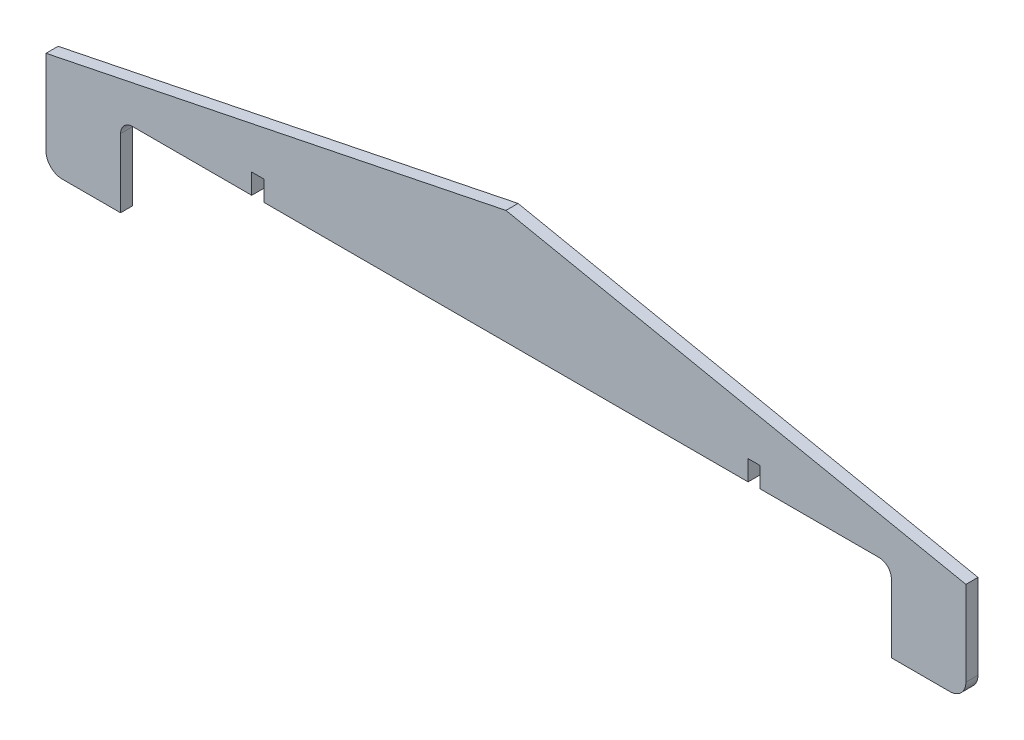
ISO-10303-21;
HEADER;
FILE_DESCRIPTION(('STEP AP214'),'2;1');
FILE_NAME('part.step','',(''),(''),'','','');
FILE_SCHEMA(('AUTOMOTIVE_DESIGN { 1 0 10303 214 1 1 1 1 }'));
ENDSEC;
DATA;
#1=APPLICATION_CONTEXT('core data for automotive mechanical design processes');
#2=APPLICATION_PROTOCOL_DEFINITION('international standard','automotive_design',2000,#1);
#3=PRODUCT_CONTEXT('',#1,'mechanical');
#4=PRODUCT('Part','Part','',(#3));
#5=PRODUCT_RELATED_PRODUCT_CATEGORY('part','',(#4));
#6=PRODUCT_DEFINITION_FORMATION('','',#4);
#7=PRODUCT_DEFINITION_CONTEXT('part definition',#1,'design');
#8=PRODUCT_DEFINITION('design','',#6,#7);
#9=PRODUCT_DEFINITION_SHAPE('','',#8);
#10=(LENGTH_UNIT() NAMED_UNIT(*) SI_UNIT(.MILLI.,.METRE.));
#11=(NAMED_UNIT(*) PLANE_ANGLE_UNIT() SI_UNIT($,.RADIAN.));
#12=(NAMED_UNIT(*) SI_UNIT($,.STERADIAN.) SOLID_ANGLE_UNIT());
#13=UNCERTAINTY_MEASURE_WITH_UNIT(LENGTH_MEASURE(1.E-05),#10,'distance_accuracy_value','');
#14=(GEOMETRIC_REPRESENTATION_CONTEXT(3) GLOBAL_UNCERTAINTY_ASSIGNED_CONTEXT((#13)) GLOBAL_UNIT_ASSIGNED_CONTEXT((#10,
#11,#12)) REPRESENTATION_CONTEXT('',''));
#15=CARTESIAN_POINT('',(0.,0.,0.));
#16=DIRECTION('',(0.,0.,1.));
#17=DIRECTION('',(1.,0.,0.));
#18=AXIS2_PLACEMENT_3D('',#15,#16,#17);
#19=CARTESIAN_POINT('',(-95.5,-5.00000000000002,0.));
#20=DIRECTION('',(0.,1.,0.));
#21=DIRECTION('',(0.,0.,1.));
#22=AXIS2_PLACEMENT_3D('',#19,#20,#21);
#23=PLANE('',#22);
#24=DIRECTION('',(-1.,0.,0.));
#25=VECTOR('',#24,1.);
#26=CARTESIAN_POINT('',(-95.5,-5.00000000000002,0.));
#27=LINE('',#26,#25);
#28=CARTESIAN_POINT('',(-63.,-5.00000000000002,0.));
#29=VERTEX_POINT('',#28);
#30=CARTESIAN_POINT('',(-92.5,-5.00000000000002,0.));
#31=VERTEX_POINT('',#30);
#32=EDGE_CURVE('E276',#29,#31,#27,.T.);
#33=ORIENTED_EDGE('',*,*,#32,.F.);
#34=DIRECTION('',(0.,0.,1.));
#35=VECTOR('',#34,1.);
#36=CARTESIAN_POINT('',(-63.,-5.00000000000002,0.));
#37=LINE('',#36,#35);
#38=CARTESIAN_POINT('',(-63.,-5.00000000000002,3.));
#39=VERTEX_POINT('',#38);
#40=EDGE_CURVE('E371',#29,#39,#37,.T.);
#41=ORIENTED_EDGE('',*,*,#40,.T.);
#42=DIRECTION('',(-1.,0.,0.));
#43=VECTOR('',#42,1.);
#44=CARTESIAN_POINT('',(-95.5,-5.00000000000002,3.));
#45=LINE('',#44,#43);
#46=CARTESIAN_POINT('',(-92.5,-5.00000000000002,3.));
#47=VERTEX_POINT('',#46);
#48=EDGE_CURVE('E284',#39,#47,#45,.T.);
#49=ORIENTED_EDGE('',*,*,#48,.T.);
#50=DIRECTION('',(0.,0.,1.));
#51=VECTOR('',#50,1.);
#52=CARTESIAN_POINT('',(-92.5,-5.00000000000002,0.));
#53=LINE('',#52,#51);
#54=EDGE_CURVE('E331',#47,#31,#53,.F.);
#55=ORIENTED_EDGE('',*,*,#54,.T.);
#56=EDGE_LOOP('',(#33,#41,#49,#55));
#57=FACE_BOUND('',#56,.T.);
#58=ADVANCED_FACE('F39',(#57),#23,.F.);
#59=CARTESIAN_POINT('',(92.5,-5.00000000000002,3.));
#60=VERTEX_POINT('',#59);
#61=CARTESIAN_POINT('',(63.,-5.00000000000002,3.));
#62=VERTEX_POINT('',#61);
#63=EDGE_CURVE('E285',#60,#62,#45,.T.);
#64=ORIENTED_EDGE('',*,*,#63,.T.);
#65=DIRECTION('',(0.,0.,-1.));
#66=VECTOR('',#65,1.);
#67=CARTESIAN_POINT('',(63.,-5.00000000000002,0.));
#68=LINE('',#67,#66);
#69=CARTESIAN_POINT('',(63.,-5.00000000000002,0.));
#70=VERTEX_POINT('',#69);
#71=EDGE_CURVE('E363',#62,#70,#68,.T.);
#72=ORIENTED_EDGE('',*,*,#71,.T.);
#73=CARTESIAN_POINT('',(92.5,-5.00000000000002,0.));
#74=VERTEX_POINT('',#73);
#75=EDGE_CURVE('E270',#74,#70,#27,.T.);
#76=ORIENTED_EDGE('',*,*,#75,.F.);
#77=DIRECTION('',(0.,0.,1.));
#78=VECTOR('',#77,1.);
#79=CARTESIAN_POINT('',(92.5,-5.00000000000002,3.));
#80=LINE('',#79,#78);
#81=EDGE_CURVE('E335',#74,#60,#80,.T.);
#82=ORIENTED_EDGE('',*,*,#81,.T.);
#83=EDGE_LOOP('',(#64,#72,#76,#82));
#84=FACE_BOUND('',#83,.T.);
#85=ADVANCED_FACE('F452',(#84),#23,.F.);
#86=CARTESIAN_POINT('',(-113.979628182664,-25.,3.));
#87=DIRECTION('',(0.,1.,0.));
#88=DIRECTION('',(0.,0.,1.));
#89=AXIS2_PLACEMENT_3D('',#86,#87,#88);
#90=PLANE('',#89);
#91=DIRECTION('',(1.,0.,0.));
#92=VECTOR('',#91,1.);
#93=CARTESIAN_POINT('',(-113.979628182664,-25.,0.));
#94=LINE('',#93,#92);
#95=CARTESIAN_POINT('',(95.5,-25.,0.));
#96=VERTEX_POINT('',#95);
#97=CARTESIAN_POINT('',(109.979628182664,-25.,0.));
#98=VERTEX_POINT('',#97);
#99=EDGE_CURVE('E318',#96,#98,#94,.T.);
#100=ORIENTED_EDGE('',*,*,#99,.T.);
#101=DIRECTION('',(0.,0.,-1.));
#102=VECTOR('',#101,1.);
#103=CARTESIAN_POINT('',(109.979628182664,-25.,3.));
#104=LINE('',#103,#102);
#105=CARTESIAN_POINT('',(109.979628182664,-25.,3.));
#106=VERTEX_POINT('',#105);
#107=EDGE_CURVE('E385',#98,#106,#104,.F.);
#108=ORIENTED_EDGE('',*,*,#107,.T.);
#109=DIRECTION('',(1.,0.,0.));
#110=VECTOR('',#109,1.);
#111=CARTESIAN_POINT('',(-113.979628182664,-25.,3.));
#112=LINE('',#111,#110);
#113=CARTESIAN_POINT('',(95.5,-25.,3.));
#114=VERTEX_POINT('',#113);
#115=EDGE_CURVE('E303',#114,#106,#112,.T.);
#116=ORIENTED_EDGE('',*,*,#115,.F.);
#117=DIRECTION('',(0.,0.,-1.));
#118=VECTOR('',#117,1.);
#119=CARTESIAN_POINT('',(95.5,-25.,3.));
#120=LINE('',#119,#118);
#121=EDGE_CURVE('E297',#114,#96,#120,.T.);
#122=ORIENTED_EDGE('',*,*,#121,.T.);
#123=EDGE_LOOP('',(#100,#108,#116,#122));
#124=FACE_BOUND('',#123,.T.);
#125=ADVANCED_FACE('F457',(#124),#90,.F.);
#126=CARTESIAN_POINT('',(16.,19.9998115287844,3.));
#127=DIRECTION('',(-0.199998115287844,-0.979796281826641,0.));
#128=DIRECTION('',(0.979796281826641,-0.199998115287844,0.));
#129=AXIS2_PLACEMENT_3D('',#126,#127,#128);
#130=PLANE('',#129);
#131=DIRECTION('',(-0.979796281826641,0.199998115287844,0.));
#132=VECTOR('',#131,1.);
#133=CARTESIAN_POINT('',(16.,19.9998115287844,0.));
#134=LINE('',#133,#132);
#135=CARTESIAN_POINT('',(113.979628182664,0.,0.));
#136=VERTEX_POINT('',#135);
#137=CARTESIAN_POINT('',(0.,23.2657657929094,0.));
#138=VERTEX_POINT('',#137);
#139=EDGE_CURVE('E207',#136,#138,#134,.T.);
#140=ORIENTED_EDGE('',*,*,#139,.T.);
#141=DIRECTION('',(0.,0.,1.));
#142=VECTOR('',#141,1.);
#143=CARTESIAN_POINT('',(0.,23.2657657929094,-53.3869774198742));
#144=LINE('',#143,#142);
#145=CARTESIAN_POINT('',(0.,23.2657657929094,3.));
#146=VERTEX_POINT('',#145);
#147=EDGE_CURVE('E187',#138,#146,#144,.T.);
#148=ORIENTED_EDGE('',*,*,#147,.T.);
#149=DIRECTION('',(-0.979796281826641,0.199998115287844,0.));
#150=VECTOR('',#149,1.);
#151=CARTESIAN_POINT('',(16.,19.9998115287844,3.));
#152=LINE('',#151,#150);
#153=CARTESIAN_POINT('',(113.979628182664,0.,3.));
#154=VERTEX_POINT('',#153);
#155=EDGE_CURVE('E192',#154,#146,#152,.T.);
#156=ORIENTED_EDGE('',*,*,#155,.F.);
#157=DIRECTION('',(0.,0.,-1.));
#158=VECTOR('',#157,1.);
#159=CARTESIAN_POINT('',(113.979628182664,0.,3.));
#160=LINE('',#159,#158);
#161=EDGE_CURVE('E309',#154,#136,#160,.T.);
#162=ORIENTED_EDGE('',*,*,#161,.T.);
#163=EDGE_LOOP('',(#140,#148,#156,#162));
#164=FACE_BOUND('',#163,.T.);
#165=ADVANCED_FACE('F205',(#164),#130,.F.);
#166=CARTESIAN_POINT('',(-113.979628182664,0.,3.));
#167=DIRECTION('',(0.199998115287844,-0.979796281826641,0.));
#168=DIRECTION('',(0.979796281826641,0.199998115287844,0.));
#169=AXIS2_PLACEMENT_3D('',#166,#167,#168);
#170=PLANE('',#169);
#171=DIRECTION('',(0.,0.,-1.));
#172=VECTOR('',#171,1.);
#173=CARTESIAN_POINT('',(-113.979628182664,0.,3.));
#174=LINE('',#173,#172);
#175=CARTESIAN_POINT('',(-113.979628182664,0.,3.));
#176=VERTEX_POINT('',#175);
#177=CARTESIAN_POINT('',(-113.979628182664,0.,0.));
#178=VERTEX_POINT('',#177);
#179=EDGE_CURVE('E189',#176,#178,#174,.T.);
#180=ORIENTED_EDGE('',*,*,#179,.F.);
#181=DIRECTION('',(-0.979796281826641,-0.199998115287844,0.));
#182=VECTOR('',#181,1.);
#183=CARTESIAN_POINT('',(-113.979628182664,0.,3.));
#184=LINE('',#183,#182);
#185=EDGE_CURVE('E183',#146,#176,#184,.T.);
#186=ORIENTED_EDGE('',*,*,#185,.F.);
#187=ORIENTED_EDGE('',*,*,#147,.F.);
#188=DIRECTION('',(-0.979796281826641,-0.199998115287844,0.));
#189=VECTOR('',#188,1.);
#190=CARTESIAN_POINT('',(-113.979628182664,0.,0.));
#191=LINE('',#190,#189);
#192=EDGE_CURVE('E312',#138,#178,#191,.T.);
#193=ORIENTED_EDGE('',*,*,#192,.T.);
#194=EDGE_LOOP('',(#180,#186,#187,#193));
#195=FACE_BOUND('',#194,.T.);
#196=ADVANCED_FACE('F185',(#195),#170,.F.);
#197=CARTESIAN_POINT('',(-113.979628182664,0.,3.));
#198=DIRECTION('',(1.,0.,0.));
#199=DIRECTION('',(0.,1.,0.));
#200=AXIS2_PLACEMENT_3D('',#197,#198,#199);
#201=PLANE('',#200);
#202=DIRECTION('',(0.,-1.,0.));
#203=VECTOR('',#202,1.);
#204=CARTESIAN_POINT('',(-113.979628182664,0.,0.));
#205=LINE('',#204,#203);
#206=CARTESIAN_POINT('',(-113.979628182664,-21.,0.));
#207=VERTEX_POINT('',#206);
#208=EDGE_CURVE('E315',#178,#207,#205,.T.);
#209=ORIENTED_EDGE('',*,*,#208,.T.);
#210=DIRECTION('',(0.,0.,-1.));
#211=VECTOR('',#210,1.);
#212=CARTESIAN_POINT('',(-113.979628182664,-21.,3.));
#213=LINE('',#212,#211);
#214=CARTESIAN_POINT('',(-113.979628182664,-21.,3.));
#215=VERTEX_POINT('',#214);
#216=EDGE_CURVE('E11',#207,#215,#213,.F.);
#217=ORIENTED_EDGE('',*,*,#216,.T.);
#218=DIRECTION('',(0.,-1.,0.));
#219=VECTOR('',#218,1.);
#220=CARTESIAN_POINT('',(-113.979628182664,0.,3.));
#221=LINE('',#220,#219);
#222=EDGE_CURVE('E191',#176,#215,#221,.T.);
#223=ORIENTED_EDGE('',*,*,#222,.F.);
#224=ORIENTED_EDGE('',*,*,#179,.T.);
#225=EDGE_LOOP('',(#209,#217,#223,#224));
#226=FACE_BOUND('',#225,.T.);
#227=ADVANCED_FACE('F506',(#226),#201,.F.);
#228=CARTESIAN_POINT('',(-109.979628182664,-25.,3.));
#229=VERTEX_POINT('',#228);
#230=CARTESIAN_POINT('',(-95.5,-25.,3.));
#231=VERTEX_POINT('',#230);
#232=EDGE_CURVE('E304',#229,#231,#112,.T.);
#233=ORIENTED_EDGE('',*,*,#232,.F.);
#234=DIRECTION('',(0.,0.,-1.));
#235=VECTOR('',#234,1.);
#236=CARTESIAN_POINT('',(-109.979628182664,-25.,3.));
#237=LINE('',#236,#235);
#238=CARTESIAN_POINT('',(-109.979628182664,-25.,0.));
#239=VERTEX_POINT('',#238);
#240=EDGE_CURVE('E48',#229,#239,#237,.T.);
#241=ORIENTED_EDGE('',*,*,#240,.T.);
#242=CARTESIAN_POINT('',(-95.5,-25.,0.));
#243=VERTEX_POINT('',#242);
#244=EDGE_CURVE('E319',#239,#243,#94,.T.);
#245=ORIENTED_EDGE('',*,*,#244,.T.);
#246=DIRECTION('',(0.,0.,1.));
#247=VECTOR('',#246,1.);
#248=CARTESIAN_POINT('',(-95.5,-25.,3.));
#249=LINE('',#248,#247);
#250=EDGE_CURVE('E280',#243,#231,#249,.T.);
#251=ORIENTED_EDGE('',*,*,#250,.T.);
#252=EDGE_LOOP('',(#233,#241,#245,#251));
#253=FACE_BOUND('',#252,.T.);
#254=ADVANCED_FACE('F397',(#253),#90,.F.);
#255=CARTESIAN_POINT('',(113.979628182664,0.,3.));
#256=DIRECTION('',(-1.,0.,0.));
#257=DIRECTION('',(0.,-1.,0.));
#258=AXIS2_PLACEMENT_3D('',#255,#256,#257);
#259=PLANE('',#258);
#260=DIRECTION('',(0.,1.,0.));
#261=VECTOR('',#260,1.);
#262=CARTESIAN_POINT('',(113.979628182664,0.,3.));
#263=LINE('',#262,#261);
#264=CARTESIAN_POINT('',(113.979628182664,-21.,3.));
#265=VERTEX_POINT('',#264);
#266=EDGE_CURVE('E197',#265,#154,#263,.T.);
#267=ORIENTED_EDGE('',*,*,#266,.F.);
#268=DIRECTION('',(0.,0.,-1.));
#269=VECTOR('',#268,1.);
#270=CARTESIAN_POINT('',(113.979628182664,-21.,3.));
#271=LINE('',#270,#269);
#272=CARTESIAN_POINT('',(113.979628182664,-21.,0.));
#273=VERTEX_POINT('',#272);
#274=EDGE_CURVE('E375',#265,#273,#271,.T.);
#275=ORIENTED_EDGE('',*,*,#274,.T.);
#276=DIRECTION('',(0.,1.,0.));
#277=VECTOR('',#276,1.);
#278=CARTESIAN_POINT('',(113.979628182664,0.,0.));
#279=LINE('',#278,#277);
#280=EDGE_CURVE('E202',#273,#136,#279,.T.);
#281=ORIENTED_EDGE('',*,*,#280,.T.);
#282=ORIENTED_EDGE('',*,*,#161,.F.);
#283=EDGE_LOOP('',(#267,#275,#281,#282));
#284=FACE_BOUND('',#283,.T.);
#285=ADVANCED_FACE('F505',(#284),#259,.F.);
#286=CARTESIAN_POINT('',(0.,0.,3.));
#287=DIRECTION('',(0.,0.,-1.));
#288=DIRECTION('',(-1.,0.,0.));
#289=AXIS2_PLACEMENT_3D('',#286,#287,#288);
#290=PLANE('',#289);
#291=ORIENTED_EDGE('',*,*,#155,.T.);
#292=ORIENTED_EDGE('',*,*,#185,.T.);
#293=ORIENTED_EDGE('',*,*,#222,.T.);
#294=CARTESIAN_POINT('',(-109.979628182664,-21.,3.));
#295=DIRECTION('',(0.,0.,-1.));
#296=DIRECTION('',(-1.,0.,0.));
#297=AXIS2_PLACEMENT_3D('',#294,#295,#296);
#298=CIRCLE('',#297,4.);
#299=EDGE_CURVE('E55',#215,#229,#298,.F.);
#300=ORIENTED_EDGE('',*,*,#299,.T.);
#301=ORIENTED_EDGE('',*,*,#232,.T.);
#302=DIRECTION('',(0.,-1.,0.));
#303=VECTOR('',#302,1.);
#304=CARTESIAN_POINT('',(-95.5,-5.00000000000002,3.));
#305=LINE('',#304,#303);
#306=CARTESIAN_POINT('',(-95.5,-8.00000000000002,3.));
#307=VERTEX_POINT('',#306);
#308=EDGE_CURVE('E289',#307,#231,#305,.T.);
#309=ORIENTED_EDGE('',*,*,#308,.F.);
#310=CARTESIAN_POINT('',(-92.5,-8.00000000000002,3.));
#311=DIRECTION('',(0.,0.,-1.));
#312=DIRECTION('',(-1.,0.,0.));
#313=AXIS2_PLACEMENT_3D('',#310,#311,#312);
#314=CIRCLE('',#313,3.);
#315=EDGE_CURVE('E352',#307,#47,#314,.T.);
#316=ORIENTED_EDGE('',*,*,#315,.T.);
#317=ORIENTED_EDGE('',*,*,#48,.F.);
#318=DIRECTION('',(0.,-1.,0.));
#319=VECTOR('',#318,1.);
#320=CARTESIAN_POINT('',(-63.,-10.,3.));
#321=LINE('',#320,#319);
#322=CARTESIAN_POINT('',(-63.,0.,3.));
#323=VERTEX_POINT('',#322);
#324=EDGE_CURVE('E229',#323,#39,#321,.T.);
#325=ORIENTED_EDGE('',*,*,#324,.F.);
#326=DIRECTION('',(-1.,0.,0.));
#327=VECTOR('',#326,1.);
#328=CARTESIAN_POINT('',(-60.,0.,3.));
#329=LINE('',#328,#327);
#330=CARTESIAN_POINT('',(-60.,0.,3.));
#331=VERTEX_POINT('',#330);
#332=EDGE_CURVE('E220',#331,#323,#329,.T.);
#333=ORIENTED_EDGE('',*,*,#332,.F.);
#334=DIRECTION('',(0.,1.,0.));
#335=VECTOR('',#334,1.);
#336=CARTESIAN_POINT('',(-60.,-10.,3.));
#337=LINE('',#336,#335);
#338=CARTESIAN_POINT('',(-60.,-5.00000000000002,3.));
#339=VERTEX_POINT('',#338);
#340=EDGE_CURVE('E232',#339,#331,#337,.T.);
#341=ORIENTED_EDGE('',*,*,#340,.F.);
#342=CARTESIAN_POINT('',(60.,-5.00000000000002,3.));
#343=VERTEX_POINT('',#342);
#344=EDGE_CURVE('E290',#343,#339,#45,.T.);
#345=ORIENTED_EDGE('',*,*,#344,.F.);
#346=DIRECTION('',(0.,-1.,0.));
#347=VECTOR('',#346,1.);
#348=CARTESIAN_POINT('',(60.,-9.99999999999997,3.));
#349=LINE('',#348,#347);
#350=CARTESIAN_POINT('',(60.,0.,3.));
#351=VERTEX_POINT('',#350);
#352=EDGE_CURVE('E251',#351,#343,#349,.T.);
#353=ORIENTED_EDGE('',*,*,#352,.F.);
#354=DIRECTION('',(-1.,0.,0.));
#355=VECTOR('',#354,1.);
#356=CARTESIAN_POINT('',(60.,0.,3.));
#357=LINE('',#356,#355);
#358=CARTESIAN_POINT('',(63.,0.,3.));
#359=VERTEX_POINT('',#358);
#360=EDGE_CURVE('E212',#359,#351,#357,.T.);
#361=ORIENTED_EDGE('',*,*,#360,.F.);
#362=DIRECTION('',(0.,1.,0.));
#363=VECTOR('',#362,1.);
#364=CARTESIAN_POINT('',(63.,-9.99999999999997,3.));
#365=LINE('',#364,#363);
#366=EDGE_CURVE('E209',#62,#359,#365,.T.);
#367=ORIENTED_EDGE('',*,*,#366,.F.);
#368=ORIENTED_EDGE('',*,*,#63,.F.);
#369=CARTESIAN_POINT('',(92.5,-8.00000000000002,3.));
#370=DIRECTION('',(0.,0.,-1.));
#371=DIRECTION('',(-1.,0.,0.));
#372=AXIS2_PLACEMENT_3D('',#369,#370,#371);
#373=CIRCLE('',#372,3.);
#374=CARTESIAN_POINT('',(95.5,-8.00000000000001,3.));
#375=VERTEX_POINT('',#374);
#376=EDGE_CURVE('E346',#60,#375,#373,.T.);
#377=ORIENTED_EDGE('',*,*,#376,.T.);
#378=DIRECTION('',(0.,1.,0.));
#379=VECTOR('',#378,1.);
#380=CARTESIAN_POINT('',(95.5,-5.00000000000002,3.));
#381=LINE('',#380,#379);
#382=EDGE_CURVE('E242',#114,#375,#381,.T.);
#383=ORIENTED_EDGE('',*,*,#382,.F.);
#384=ORIENTED_EDGE('',*,*,#115,.T.);
#385=CARTESIAN_POINT('',(109.979628182664,-21.,3.));
#386=DIRECTION('',(0.,0.,-1.));
#387=DIRECTION('',(-1.,0.,0.));
#388=AXIS2_PLACEMENT_3D('',#385,#386,#387);
#389=CIRCLE('',#388,4.);
#390=EDGE_CURVE('E390',#106,#265,#389,.F.);
#391=ORIENTED_EDGE('',*,*,#390,.T.);
#392=ORIENTED_EDGE('',*,*,#266,.T.);
#393=EDGE_LOOP('',(#291,#292,#293,#300,#301,#309,#316,#317,#325,#333,#341,#345,#353,#361,#367,
#368,#377,#383,#384,#391,#392));
#394=FACE_BOUND('',#393,.T.);
#395=ADVANCED_FACE('F195',(#394),#290,.F.);
#396=CARTESIAN_POINT('',(0.,0.,0.));
#397=DIRECTION('',(0.,0.,-1.));
#398=DIRECTION('',(-1.,0.,0.));
#399=AXIS2_PLACEMENT_3D('',#396,#397,#398);
#400=PLANE('',#399);
#401=ORIENTED_EDGE('',*,*,#208,.F.);
#402=ORIENTED_EDGE('',*,*,#192,.F.);
#403=ORIENTED_EDGE('',*,*,#139,.F.);
#404=ORIENTED_EDGE('',*,*,#280,.F.);
#405=CARTESIAN_POINT('',(109.979628182664,-21.,0.));
#406=DIRECTION('',(0.,0.,-1.));
#407=DIRECTION('',(-1.,0.,0.));
#408=AXIS2_PLACEMENT_3D('',#405,#406,#407);
#409=CIRCLE('',#408,4.);
#410=EDGE_CURVE('E382',#273,#98,#409,.T.);
#411=ORIENTED_EDGE('',*,*,#410,.T.);
#412=ORIENTED_EDGE('',*,*,#99,.F.);
#413=DIRECTION('',(0.,-1.,0.));
#414=VECTOR('',#413,1.);
#415=CARTESIAN_POINT('',(95.5,0.,0.));
#416=LINE('',#415,#414);
#417=CARTESIAN_POINT('',(95.5,-8.00000000000001,0.));
#418=VERTEX_POINT('',#417);
#419=EDGE_CURVE('E328',#418,#96,#416,.T.);
#420=ORIENTED_EDGE('',*,*,#419,.F.);
#421=CARTESIAN_POINT('',(92.5,-8.00000000000002,0.));
#422=DIRECTION('',(0.,0.,-1.));
#423=DIRECTION('',(-1.,0.,0.));
#424=AXIS2_PLACEMENT_3D('',#421,#422,#423);
#425=CIRCLE('',#424,3.);
#426=EDGE_CURVE('E349',#418,#74,#425,.F.);
#427=ORIENTED_EDGE('',*,*,#426,.T.);
#428=ORIENTED_EDGE('',*,*,#75,.T.);
#429=DIRECTION('',(0.,1.,0.));
#430=VECTOR('',#429,1.);
#431=CARTESIAN_POINT('',(63.,-9.99999999999997,0.));
#432=LINE('',#431,#430);
#433=CARTESIAN_POINT('',(63.,0.,0.));
#434=VERTEX_POINT('',#433);
#435=EDGE_CURVE('E246',#70,#434,#432,.T.);
#436=ORIENTED_EDGE('',*,*,#435,.T.);
#437=DIRECTION('',(-1.,0.,0.));
#438=VECTOR('',#437,1.);
#439=CARTESIAN_POINT('',(60.,0.,0.));
#440=LINE('',#439,#438);
#441=CARTESIAN_POINT('',(60.,0.,0.));
#442=VERTEX_POINT('',#441);
#443=EDGE_CURVE('E250',#434,#442,#440,.T.);
#444=ORIENTED_EDGE('',*,*,#443,.T.);
#445=DIRECTION('',(0.,-1.,0.));
#446=VECTOR('',#445,1.);
#447=CARTESIAN_POINT('',(60.,-9.99999999999997,0.));
#448=LINE('',#447,#446);
#449=CARTESIAN_POINT('',(60.,-5.00000000000002,0.));
#450=VERTEX_POINT('',#449);
#451=EDGE_CURVE('E255',#442,#450,#448,.T.);
#452=ORIENTED_EDGE('',*,*,#451,.T.);
#453=CARTESIAN_POINT('',(-60.,-5.00000000000002,0.));
#454=VERTEX_POINT('',#453);
#455=EDGE_CURVE('E275',#450,#454,#27,.T.);
#456=ORIENTED_EDGE('',*,*,#455,.T.);
#457=DIRECTION('',(0.,1.,0.));
#458=VECTOR('',#457,1.);
#459=CARTESIAN_POINT('',(-60.,-10.,0.));
#460=LINE('',#459,#458);
#461=CARTESIAN_POINT('',(-60.,0.,0.));
#462=VERTEX_POINT('',#461);
#463=EDGE_CURVE('E219',#454,#462,#460,.T.);
#464=ORIENTED_EDGE('',*,*,#463,.T.);
#465=DIRECTION('',(-1.,0.,0.));
#466=VECTOR('',#465,1.);
#467=CARTESIAN_POINT('',(-60.,0.,0.));
#468=LINE('',#467,#466);
#469=CARTESIAN_POINT('',(-63.,0.,0.));
#470=VERTEX_POINT('',#469);
#471=EDGE_CURVE('E224',#462,#470,#468,.T.);
#472=ORIENTED_EDGE('',*,*,#471,.T.);
#473=DIRECTION('',(0.,-1.,0.));
#474=VECTOR('',#473,1.);
#475=CARTESIAN_POINT('',(-63.,-10.,0.));
#476=LINE('',#475,#474);
#477=EDGE_CURVE('E215',#470,#29,#476,.T.);
#478=ORIENTED_EDGE('',*,*,#477,.T.);
#479=ORIENTED_EDGE('',*,*,#32,.T.);
#480=CARTESIAN_POINT('',(-92.5,-8.00000000000002,0.));
#481=DIRECTION('',(0.,0.,-1.));
#482=DIRECTION('',(-1.,0.,0.));
#483=AXIS2_PLACEMENT_3D('',#480,#481,#482);
#484=CIRCLE('',#483,3.);
#485=CARTESIAN_POINT('',(-95.5,-8.00000000000002,0.));
#486=VERTEX_POINT('',#485);
#487=EDGE_CURVE('E356',#31,#486,#484,.F.);
#488=ORIENTED_EDGE('',*,*,#487,.T.);
#489=DIRECTION('',(0.,-1.,0.));
#490=VECTOR('',#489,1.);
#491=CARTESIAN_POINT('',(-95.5,-5.00000000000002,0.));
#492=LINE('',#491,#490);
#493=EDGE_CURVE('E274',#486,#243,#492,.T.);
#494=ORIENTED_EDGE('',*,*,#493,.T.);
#495=ORIENTED_EDGE('',*,*,#244,.F.);
#496=CARTESIAN_POINT('',(-109.979628182664,-21.,0.));
#497=DIRECTION('',(0.,0.,-1.));
#498=DIRECTION('',(-1.,0.,0.));
#499=AXIS2_PLACEMENT_3D('',#496,#497,#498);
#500=CIRCLE('',#499,4.);
#501=EDGE_CURVE('E379',#239,#207,#500,.T.);
#502=ORIENTED_EDGE('',*,*,#501,.T.);
#503=EDGE_LOOP('',(#401,#402,#403,#404,#411,#412,#420,#427,#428,#436,#444,#452,#456,#464,#472,
#478,#479,#488,#494,#495,#502));
#504=FACE_BOUND('',#503,.T.);
#505=ADVANCED_FACE('F401',(#504),#400,.T.);
#506=CARTESIAN_POINT('',(95.5,-5.00000000000002,0.));
#507=DIRECTION('',(1.,0.,0.));
#508=DIRECTION('',(0.,1.,0.));
#509=AXIS2_PLACEMENT_3D('',#506,#507,#508);
#510=PLANE('',#509);
#511=ORIENTED_EDGE('',*,*,#382,.T.);
#512=DIRECTION('',(0.,0.,1.));
#513=VECTOR('',#512,1.);
#514=CARTESIAN_POINT('',(95.5,-8.00000000000001,0.));
#515=LINE('',#514,#513);
#516=EDGE_CURVE('E339',#375,#418,#515,.F.);
#517=ORIENTED_EDGE('',*,*,#516,.T.);
#518=ORIENTED_EDGE('',*,*,#419,.T.);
#519=ORIENTED_EDGE('',*,*,#121,.F.);
#520=EDGE_LOOP('',(#511,#517,#518,#519));
#521=FACE_BOUND('',#520,.T.);
#522=ADVANCED_FACE('F469',(#521),#510,.F.);
#523=CARTESIAN_POINT('',(-95.5,-5.00000000000002,0.));
#524=DIRECTION('',(-1.,0.,0.));
#525=DIRECTION('',(0.,0.,1.));
#526=AXIS2_PLACEMENT_3D('',#523,#524,#525);
#527=PLANE('',#526);
#528=ORIENTED_EDGE('',*,*,#493,.F.);
#529=DIRECTION('',(0.,0.,1.));
#530=VECTOR('',#529,1.);
#531=CARTESIAN_POINT('',(-95.5,-8.00000000000002,3.));
#532=LINE('',#531,#530);
#533=EDGE_CURVE('E342',#486,#307,#532,.T.);
#534=ORIENTED_EDGE('',*,*,#533,.T.);
#535=ORIENTED_EDGE('',*,*,#308,.T.);
#536=ORIENTED_EDGE('',*,*,#250,.F.);
#537=EDGE_LOOP('',(#528,#534,#535,#536));
#538=FACE_BOUND('',#537,.T.);
#539=ADVANCED_FACE('F407',(#538),#527,.F.);
#540=ORIENTED_EDGE('',*,*,#344,.T.);
#541=DIRECTION('',(0.,0.,-1.));
#542=VECTOR('',#541,1.);
#543=CARTESIAN_POINT('',(-60.,-5.00000000000002,0.));
#544=LINE('',#543,#542);
#545=EDGE_CURVE('E367',#339,#454,#544,.T.);
#546=ORIENTED_EDGE('',*,*,#545,.T.);
#547=ORIENTED_EDGE('',*,*,#455,.F.);
#548=DIRECTION('',(0.,0.,1.));
#549=VECTOR('',#548,1.);
#550=CARTESIAN_POINT('',(60.,-5.00000000000002,0.));
#551=LINE('',#550,#549);
#552=EDGE_CURVE('E359',#450,#343,#551,.T.);
#553=ORIENTED_EDGE('',*,*,#552,.T.);
#554=EDGE_LOOP('',(#540,#546,#547,#553));
#555=FACE_BOUND('',#554,.T.);
#556=ADVANCED_FACE('F421',(#555),#23,.F.);
#557=CARTESIAN_POINT('',(92.5,-8.00000000000002,0.));
#558=DIRECTION('',(0.,0.,-1.));
#559=DIRECTION('',(-1.,0.,0.));
#560=AXIS2_PLACEMENT_3D('',#557,#558,#559);
#561=CYLINDRICAL_SURFACE('',#560,3.);
#562=ORIENTED_EDGE('',*,*,#426,.F.);
#563=ORIENTED_EDGE('',*,*,#516,.F.);
#564=ORIENTED_EDGE('',*,*,#376,.F.);
#565=ORIENTED_EDGE('',*,*,#81,.F.);
#566=EDGE_LOOP('',(#562,#563,#564,#565));
#567=FACE_BOUND('',#566,.T.);
#568=ADVANCED_FACE('F462',(#567),#561,.F.);
#569=CARTESIAN_POINT('',(-92.5,-8.00000000000002,0.));
#570=DIRECTION('',(0.,0.,-1.));
#571=DIRECTION('',(-1.,0.,0.));
#572=AXIS2_PLACEMENT_3D('',#569,#570,#571);
#573=CYLINDRICAL_SURFACE('',#572,3.);
#574=ORIENTED_EDGE('',*,*,#487,.F.);
#575=ORIENTED_EDGE('',*,*,#54,.F.);
#576=ORIENTED_EDGE('',*,*,#315,.F.);
#577=ORIENTED_EDGE('',*,*,#533,.F.);
#578=EDGE_LOOP('',(#574,#575,#576,#577));
#579=FACE_BOUND('',#578,.T.);
#580=ADVANCED_FACE('F413',(#579),#573,.F.);
#581=CARTESIAN_POINT('',(63.,-9.99999999999997,0.));
#582=DIRECTION('',(1.,0.,0.));
#583=DIRECTION('',(0.,0.,-1.));
#584=AXIS2_PLACEMENT_3D('',#581,#582,#583);
#585=PLANE('',#584);
#586=ORIENTED_EDGE('',*,*,#366,.T.);
#587=DIRECTION('',(0.,0.,1.));
#588=VECTOR('',#587,1.);
#589=CARTESIAN_POINT('',(63.,0.,0.));
#590=LINE('',#589,#588);
#591=EDGE_CURVE('E258',#434,#359,#590,.T.);
#592=ORIENTED_EDGE('',*,*,#591,.F.);
#593=ORIENTED_EDGE('',*,*,#435,.F.);
#594=ORIENTED_EDGE('',*,*,#71,.F.);
#595=EDGE_LOOP('',(#586,#592,#593,#594));
#596=FACE_BOUND('',#595,.T.);
#597=ADVANCED_FACE('F475',(#596),#585,.F.);
#598=CARTESIAN_POINT('',(60.,-9.99999999999997,0.));
#599=DIRECTION('',(-1.,0.,0.));
#600=DIRECTION('',(0.,0.,1.));
#601=AXIS2_PLACEMENT_3D('',#598,#599,#600);
#602=PLANE('',#601);
#603=ORIENTED_EDGE('',*,*,#451,.F.);
#604=DIRECTION('',(0.,0.,1.));
#605=VECTOR('',#604,1.);
#606=CARTESIAN_POINT('',(60.,0.,0.));
#607=LINE('',#606,#605);
#608=EDGE_CURVE('E233',#442,#351,#607,.T.);
#609=ORIENTED_EDGE('',*,*,#608,.T.);
#610=ORIENTED_EDGE('',*,*,#352,.T.);
#611=ORIENTED_EDGE('',*,*,#552,.F.);
#612=EDGE_LOOP('',(#603,#609,#610,#611));
#613=FACE_BOUND('',#612,.T.);
#614=ADVANCED_FACE('F447',(#613),#602,.F.);
#615=CARTESIAN_POINT('',(60.,0.,0.));
#616=DIRECTION('',(0.,1.,0.));
#617=DIRECTION('',(0.,0.,1.));
#618=AXIS2_PLACEMENT_3D('',#615,#616,#617);
#619=PLANE('',#618);
#620=ORIENTED_EDGE('',*,*,#360,.T.);
#621=ORIENTED_EDGE('',*,*,#608,.F.);
#622=ORIENTED_EDGE('',*,*,#443,.F.);
#623=ORIENTED_EDGE('',*,*,#591,.T.);
#624=EDGE_LOOP('',(#620,#621,#622,#623));
#625=FACE_BOUND('',#624,.T.);
#626=ADVANCED_FACE('F440',(#625),#619,.F.);
#627=CARTESIAN_POINT('',(-63.,-10.,0.));
#628=DIRECTION('',(-1.,0.,0.));
#629=DIRECTION('',(0.,0.,1.));
#630=AXIS2_PLACEMENT_3D('',#627,#628,#629);
#631=PLANE('',#630);
#632=ORIENTED_EDGE('',*,*,#477,.F.);
#633=DIRECTION('',(0.,0.,1.));
#634=VECTOR('',#633,1.);
#635=CARTESIAN_POINT('',(-63.,0.,0.));
#636=LINE('',#635,#634);
#637=EDGE_CURVE('E239',#470,#323,#636,.T.);
#638=ORIENTED_EDGE('',*,*,#637,.T.);
#639=ORIENTED_EDGE('',*,*,#324,.T.);
#640=ORIENTED_EDGE('',*,*,#40,.F.);
#641=EDGE_LOOP('',(#632,#638,#639,#640));
#642=FACE_BOUND('',#641,.T.);
#643=ADVANCED_FACE('F438',(#642),#631,.F.);
#644=CARTESIAN_POINT('',(-60.,-10.,0.));
#645=DIRECTION('',(1.,0.,0.));
#646=DIRECTION('',(0.,0.,-1.));
#647=AXIS2_PLACEMENT_3D('',#644,#645,#646);
#648=PLANE('',#647);
#649=ORIENTED_EDGE('',*,*,#340,.T.);
#650=DIRECTION('',(0.,0.,1.));
#651=VECTOR('',#650,1.);
#652=CARTESIAN_POINT('',(-60.,0.,0.));
#653=LINE('',#652,#651);
#654=EDGE_CURVE('E228',#462,#331,#653,.T.);
#655=ORIENTED_EDGE('',*,*,#654,.F.);
#656=ORIENTED_EDGE('',*,*,#463,.F.);
#657=ORIENTED_EDGE('',*,*,#545,.F.);
#658=EDGE_LOOP('',(#649,#655,#656,#657));
#659=FACE_BOUND('',#658,.T.);
#660=ADVANCED_FACE('F429',(#659),#648,.F.);
#661=CARTESIAN_POINT('',(-60.,0.,0.));
#662=DIRECTION('',(0.,1.,0.));
#663=DIRECTION('',(0.,0.,1.));
#664=AXIS2_PLACEMENT_3D('',#661,#662,#663);
#665=PLANE('',#664);
#666=ORIENTED_EDGE('',*,*,#332,.T.);
#667=ORIENTED_EDGE('',*,*,#637,.F.);
#668=ORIENTED_EDGE('',*,*,#471,.F.);
#669=ORIENTED_EDGE('',*,*,#654,.T.);
#670=EDGE_LOOP('',(#666,#667,#668,#669));
#671=FACE_BOUND('',#670,.T.);
#672=ADVANCED_FACE('F432',(#671),#665,.F.);
#673=CARTESIAN_POINT('',(109.979628182664,-21.,3.));
#674=DIRECTION('',(0.,0.,-1.));
#675=DIRECTION('',(-1.,0.,0.));
#676=AXIS2_PLACEMENT_3D('',#673,#674,#675);
#677=CYLINDRICAL_SURFACE('',#676,4.);
#678=ORIENTED_EDGE('',*,*,#390,.F.);
#679=ORIENTED_EDGE('',*,*,#107,.F.);
#680=ORIENTED_EDGE('',*,*,#410,.F.);
#681=ORIENTED_EDGE('',*,*,#274,.F.);
#682=EDGE_LOOP('',(#678,#679,#680,#681));
#683=FACE_BOUND('',#682,.T.);
#684=ADVANCED_FACE('F503',(#683),#677,.T.);
#685=CARTESIAN_POINT('',(-109.979628182664,-21.,3.));
#686=DIRECTION('',(0.,0.,-1.));
#687=DIRECTION('',(-1.,0.,0.));
#688=AXIS2_PLACEMENT_3D('',#685,#686,#687);
#689=CYLINDRICAL_SURFACE('',#688,4.);
#690=ORIENTED_EDGE('',*,*,#299,.F.);
#691=ORIENTED_EDGE('',*,*,#216,.F.);
#692=ORIENTED_EDGE('',*,*,#501,.F.);
#693=ORIENTED_EDGE('',*,*,#240,.F.);
#694=EDGE_LOOP('',(#690,#691,#692,#693));
#695=FACE_BOUND('',#694,.T.);
#696=ADVANCED_FACE('F41',(#695),#689,.T.);
#697=CLOSED_SHELL('',(#58,#85,#125,#165,#196,#227,#254,#285,#395,#505,#522,#539,#556,#568,#580,
#597,#614,#626,#643,#660,#672,#684,#696));
#698=MANIFOLD_SOLID_BREP('B2',#697);
#699=ADVANCED_BREP_SHAPE_REPRESENTATION('',(#18,#698),#14);
#700=SHAPE_DEFINITION_REPRESENTATION(#9,#699);
ENDSEC;
END-ISO-10303-21;
